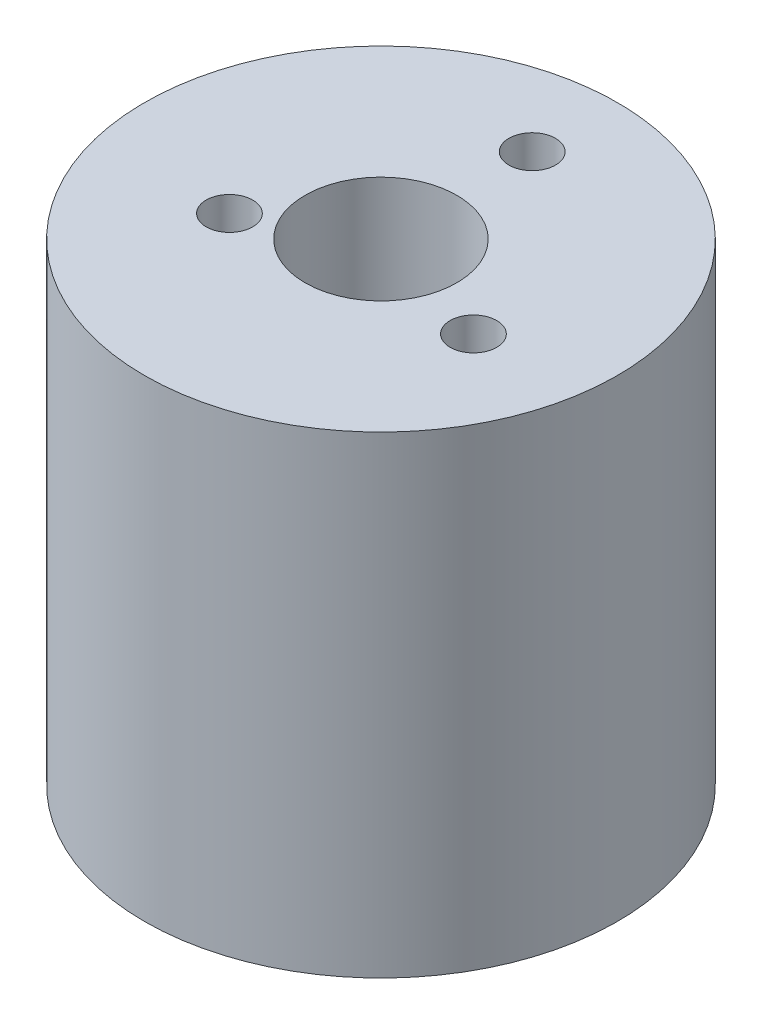
ISO-10303-21;
HEADER;
FILE_DESCRIPTION(('STEP AP214'),'2;1');
FILE_NAME('part.step','',(''),(''),'','','');
FILE_SCHEMA(('AUTOMOTIVE_DESIGN { 1 0 10303 214 1 1 1 1 }'));
ENDSEC;
DATA;
#1=APPLICATION_CONTEXT('core data for automotive mechanical design processes');
#2=APPLICATION_PROTOCOL_DEFINITION('international standard','automotive_design',2000,#1);
#3=PRODUCT_CONTEXT('',#1,'mechanical');
#4=PRODUCT('Part','Part','',(#3));
#5=PRODUCT_RELATED_PRODUCT_CATEGORY('part','',(#4));
#6=PRODUCT_DEFINITION_FORMATION('','',#4);
#7=PRODUCT_DEFINITION_CONTEXT('part definition',#1,'design');
#8=PRODUCT_DEFINITION('design','',#6,#7);
#9=PRODUCT_DEFINITION_SHAPE('','',#8);
#10=(LENGTH_UNIT() NAMED_UNIT(*) SI_UNIT(.MILLI.,.METRE.));
#11=(NAMED_UNIT(*) PLANE_ANGLE_UNIT() SI_UNIT($,.RADIAN.));
#12=(NAMED_UNIT(*) SI_UNIT($,.STERADIAN.) SOLID_ANGLE_UNIT());
#13=UNCERTAINTY_MEASURE_WITH_UNIT(LENGTH_MEASURE(1.E-05),#10,'distance_accuracy_value','');
#14=(GEOMETRIC_REPRESENTATION_CONTEXT(3) GLOBAL_UNCERTAINTY_ASSIGNED_CONTEXT((#13)) GLOBAL_UNIT_ASSIGNED_CONTEXT((#10,
#11,#12)) REPRESENTATION_CONTEXT('',''));
#15=CARTESIAN_POINT('',(0.,0.,0.));
#16=DIRECTION('',(0.,0.,1.));
#17=DIRECTION('',(1.,0.,0.));
#18=AXIS2_PLACEMENT_3D('',#15,#16,#17);
#19=CARTESIAN_POINT('',(0.,25.4,0.));
#20=DIRECTION('',(0.,-1.,0.));
#21=DIRECTION('',(0.,0.,-1.));
#22=AXIS2_PLACEMENT_3D('',#19,#20,#21);
#23=CYLINDRICAL_SURFACE('',#22,12.7);
#24=CARTESIAN_POINT('',(0.,25.4,0.));
#25=DIRECTION('',(0.,1.,0.));
#26=DIRECTION('',(0.,0.,1.));
#27=AXIS2_PLACEMENT_3D('',#24,#25,#26);
#28=CIRCLE('',#27,12.7);
#29=CARTESIAN_POINT('',(0.,25.4,12.7));
#30=VERTEX_POINT('',#29);
#31=EDGE_CURVE('E10',#30,#30,#28,.T.);
#32=ORIENTED_EDGE('',*,*,#31,.F.);
#33=EDGE_LOOP('',(#32));
#34=FACE_BOUND('',#33,.T.);
#35=CARTESIAN_POINT('',(0.,0.,0.));
#36=DIRECTION('',(0.,1.,0.));
#37=DIRECTION('',(0.,0.,1.));
#38=AXIS2_PLACEMENT_3D('',#35,#36,#37);
#39=CIRCLE('',#38,12.7);
#40=CARTESIAN_POINT('',(0.,0.,12.7));
#41=VERTEX_POINT('',#40);
#42=EDGE_CURVE('E34',#41,#41,#39,.T.);
#43=ORIENTED_EDGE('',*,*,#42,.T.);
#44=EDGE_LOOP('',(#43));
#45=FACE_BOUND('',#44,.T.);
#46=ADVANCED_FACE('F31',(#34,#45),#23,.T.);
#47=CARTESIAN_POINT('',(0.,25.4,0.));
#48=DIRECTION('',(0.,1.,0.));
#49=DIRECTION('',(0.,0.,1.));
#50=AXIS2_PLACEMENT_3D('',#47,#48,#49);
#51=PLANE('',#50);
#52=CARTESIAN_POINT('',(0.,25.4,-8.125));
#53=DIRECTION('',(0.,1.,0.));
#54=DIRECTION('',(0.,0.,1.));
#55=AXIS2_PLACEMENT_3D('',#52,#53,#54);
#56=CIRCLE('',#55,1.249999999993);
#57=CARTESIAN_POINT('',(0.,25.4,-6.87500000000701));
#58=VERTEX_POINT('',#57);
#59=EDGE_CURVE('E61',#58,#58,#56,.T.);
#60=ORIENTED_EDGE('',*,*,#59,.F.);
#61=EDGE_LOOP('',(#60));
#62=FACE_BOUND('',#61,.T.);
#63=CARTESIAN_POINT('',(-5.25875141008996,25.4,2.87846462665028));
#64=DIRECTION('',(0.,1.,0.));
#65=DIRECTION('',(0.,0.,1.));
#66=AXIS2_PLACEMENT_3D('',#63,#64,#65);
#67=CIRCLE('',#66,1.2500000000011);
#68=CARTESIAN_POINT('',(-5.25875141008996,25.4,4.12846462665138));
#69=VERTEX_POINT('',#68);
#70=EDGE_CURVE('E58',#69,#69,#67,.T.);
#71=ORIENTED_EDGE('',*,*,#70,.F.);
#72=EDGE_LOOP('',(#71));
#73=FACE_BOUND('',#72,.T.);
#74=CARTESIAN_POINT('',(6.89990419127762,25.4,1.93094462665028));
#75=DIRECTION('',(0.,1.,0.));
#76=DIRECTION('',(0.,0.,1.));
#77=AXIS2_PLACEMENT_3D('',#74,#75,#76);
#78=CIRCLE('',#77,1.25000000000348);
#79=CARTESIAN_POINT('',(6.89990419127762,25.4,3.18094462665376));
#80=VERTEX_POINT('',#79);
#81=EDGE_CURVE('E52',#80,#80,#78,.T.);
#82=ORIENTED_EDGE('',*,*,#81,.F.);
#83=EDGE_LOOP('',(#82));
#84=FACE_BOUND('',#83,.T.);
#85=CARTESIAN_POINT('',(0.,25.4,0.));
#86=DIRECTION('',(0.,1.,0.));
#87=DIRECTION('',(0.,0.,1.));
#88=AXIS2_PLACEMENT_3D('',#85,#86,#87);
#89=CIRCLE('',#88,4.075);
#90=CARTESIAN_POINT('',(0.,25.4,4.075));
#91=VERTEX_POINT('',#90);
#92=EDGE_CURVE('E43',#91,#91,#89,.T.);
#93=ORIENTED_EDGE('',*,*,#92,.F.);
#94=EDGE_LOOP('',(#93));
#95=FACE_BOUND('',#94,.T.);
#96=ORIENTED_EDGE('',*,*,#31,.T.);
#97=EDGE_LOOP('',(#96));
#98=FACE_BOUND('',#97,.T.);
#99=ADVANCED_FACE('F76',(#62,#73,#84,#95,#98),#51,.T.);
#100=CARTESIAN_POINT('',(0.,0.,0.));
#101=DIRECTION('',(0.,1.,0.));
#102=DIRECTION('',(0.,0.,1.));
#103=AXIS2_PLACEMENT_3D('',#100,#101,#102);
#104=PLANE('',#103);
#105=ORIENTED_EDGE('',*,*,#42,.F.);
#106=EDGE_LOOP('',(#105));
#107=FACE_BOUND('',#106,.T.);
#108=ADVANCED_FACE('F79',(#107),#104,.F.);
#109=CARTESIAN_POINT('',(0.,6.35,0.));
#110=DIRECTION('',(0.,1.,0.));
#111=DIRECTION('',(0.,0.,1.));
#112=AXIS2_PLACEMENT_3D('',#109,#110,#111);
#113=CYLINDRICAL_SURFACE('',#112,4.075);
#114=CARTESIAN_POINT('',(0.,6.35,0.));
#115=DIRECTION('',(0.,1.,0.));
#116=DIRECTION('',(0.,0.,1.));
#117=AXIS2_PLACEMENT_3D('',#114,#115,#116);
#118=CIRCLE('',#117,4.075);
#119=CARTESIAN_POINT('',(0.,6.35,4.075));
#120=VERTEX_POINT('',#119);
#121=EDGE_CURVE('E41',#120,#120,#118,.T.);
#122=ORIENTED_EDGE('',*,*,#121,.F.);
#123=EDGE_LOOP('',(#122));
#124=FACE_BOUND('',#123,.T.);
#125=ORIENTED_EDGE('',*,*,#92,.T.);
#126=EDGE_LOOP('',(#125));
#127=FACE_BOUND('',#126,.T.);
#128=ADVANCED_FACE('F87',(#124,#127),#113,.F.);
#129=CARTESIAN_POINT('',(0.,6.35,0.));
#130=DIRECTION('',(0.,1.,0.));
#131=DIRECTION('',(0.,0.,1.));
#132=AXIS2_PLACEMENT_3D('',#129,#130,#131);
#133=PLANE('',#132);
#134=ORIENTED_EDGE('',*,*,#121,.T.);
#135=EDGE_LOOP('',(#134));
#136=FACE_BOUND('',#135,.T.);
#137=ADVANCED_FACE('F89',(#136),#133,.T.);
#138=CARTESIAN_POINT('',(6.89990419127762,13.4,1.93094462665028));
#139=DIRECTION('',(0.,1.,0.));
#140=DIRECTION('',(0.,0.,1.));
#141=AXIS2_PLACEMENT_3D('',#138,#139,#140);
#142=CYLINDRICAL_SURFACE('',#141,1.25000000000348);
#143=CARTESIAN_POINT('',(6.89990419127762,13.4,1.93094462665028));
#144=DIRECTION('',(0.,1.,0.));
#145=DIRECTION('',(0.,0.,1.));
#146=AXIS2_PLACEMENT_3D('',#143,#144,#145);
#147=CIRCLE('',#146,1.25000000000348);
#148=CARTESIAN_POINT('',(6.89990419127762,13.4,3.18094462665376));
#149=VERTEX_POINT('',#148);
#150=EDGE_CURVE('E49',#149,#149,#147,.T.);
#151=ORIENTED_EDGE('',*,*,#150,.F.);
#152=EDGE_LOOP('',(#151));
#153=FACE_BOUND('',#152,.T.);
#154=ORIENTED_EDGE('',*,*,#81,.T.);
#155=EDGE_LOOP('',(#154));
#156=FACE_BOUND('',#155,.T.);
#157=ADVANCED_FACE('F96',(#153,#156),#142,.F.);
#158=CARTESIAN_POINT('',(6.89990419127762,13.4,1.93094462665028));
#159=DIRECTION('',(0.,1.,0.));
#160=DIRECTION('',(0.,0.,1.));
#161=AXIS2_PLACEMENT_3D('',#158,#159,#160);
#162=PLANE('',#161);
#163=ORIENTED_EDGE('',*,*,#150,.T.);
#164=EDGE_LOOP('',(#163));
#165=FACE_BOUND('',#164,.T.);
#166=ADVANCED_FACE('F134',(#165),#162,.T.);
#167=CARTESIAN_POINT('',(-5.25875141008996,13.4,2.87846462665028));
#168=DIRECTION('',(0.,1.,0.));
#169=DIRECTION('',(0.,0.,1.));
#170=AXIS2_PLACEMENT_3D('',#167,#168,#169);
#171=CYLINDRICAL_SURFACE('',#170,1.2500000000011);
#172=CARTESIAN_POINT('',(-5.25875141008996,13.4,2.87846462665028));
#173=DIRECTION('',(0.,1.,0.));
#174=DIRECTION('',(0.,0.,1.));
#175=AXIS2_PLACEMENT_3D('',#172,#173,#174);
#176=CIRCLE('',#175,1.2500000000011);
#177=CARTESIAN_POINT('',(-5.25875141008996,13.4,4.12846462665138));
#178=VERTEX_POINT('',#177);
#179=EDGE_CURVE('E55',#178,#178,#176,.T.);
#180=ORIENTED_EDGE('',*,*,#179,.F.);
#181=EDGE_LOOP('',(#180));
#182=FACE_BOUND('',#181,.T.);
#183=ORIENTED_EDGE('',*,*,#70,.T.);
#184=EDGE_LOOP('',(#183));
#185=FACE_BOUND('',#184,.T.);
#186=ADVANCED_FACE('F141',(#182,#185),#171,.F.);
#187=CARTESIAN_POINT('',(-5.25875141008996,13.4,2.87846462665028));
#188=DIRECTION('',(0.,1.,0.));
#189=DIRECTION('',(0.,0.,1.));
#190=AXIS2_PLACEMENT_3D('',#187,#188,#189);
#191=PLANE('',#190);
#192=ORIENTED_EDGE('',*,*,#179,.T.);
#193=EDGE_LOOP('',(#192));
#194=FACE_BOUND('',#193,.T.);
#195=ADVANCED_FACE('F72',(#194),#191,.T.);
#196=CARTESIAN_POINT('',(0.,13.4,-8.125));
#197=DIRECTION('',(0.,1.,0.));
#198=DIRECTION('',(0.,0.,1.));
#199=AXIS2_PLACEMENT_3D('',#196,#197,#198);
#200=CYLINDRICAL_SURFACE('',#199,1.249999999993);
#201=CARTESIAN_POINT('',(0.,13.4,-8.125));
#202=DIRECTION('',(0.,1.,0.));
#203=DIRECTION('',(0.,0.,1.));
#204=AXIS2_PLACEMENT_3D('',#201,#202,#203);
#205=CIRCLE('',#204,1.249999999993);
#206=CARTESIAN_POINT('',(0.,13.4,-6.87500000000701));
#207=VERTEX_POINT('',#206);
#208=EDGE_CURVE('E46',#207,#207,#205,.T.);
#209=ORIENTED_EDGE('',*,*,#208,.F.);
#210=EDGE_LOOP('',(#209));
#211=FACE_BOUND('',#210,.T.);
#212=ORIENTED_EDGE('',*,*,#59,.T.);
#213=EDGE_LOOP('',(#212));
#214=FACE_BOUND('',#213,.T.);
#215=ADVANCED_FACE('F69',(#211,#214),#200,.F.);
#216=CARTESIAN_POINT('',(0.,13.4,-8.125));
#217=DIRECTION('',(0.,1.,0.));
#218=DIRECTION('',(0.,0.,1.));
#219=AXIS2_PLACEMENT_3D('',#216,#217,#218);
#220=PLANE('',#219);
#221=ORIENTED_EDGE('',*,*,#208,.T.);
#222=EDGE_LOOP('',(#221));
#223=FACE_BOUND('',#222,.T.);
#224=ADVANCED_FACE('F67',(#223),#220,.T.);
#225=CLOSED_SHELL('',(#46,#99,#108,#128,#137,#157,#166,#186,#195,#215,#224));
#226=MANIFOLD_SOLID_BREP('B2',#225);
#227=ADVANCED_BREP_SHAPE_REPRESENTATION('',(#18,#226),#14);
#228=SHAPE_DEFINITION_REPRESENTATION(#9,#227);
ENDSEC;
END-ISO-10303-21;
